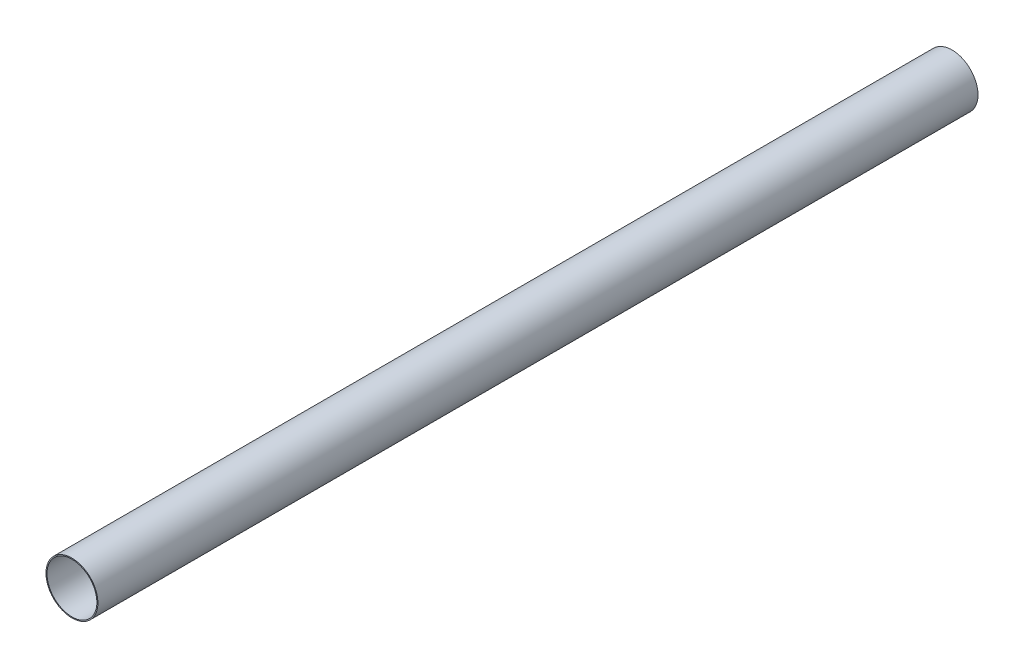
ISO-10303-21;
HEADER;
FILE_DESCRIPTION(('STEP AP214'),'2;1');
FILE_NAME('part.step','',(''),(''),'','','');
FILE_SCHEMA(('AUTOMOTIVE_DESIGN { 1 0 10303 214 1 1 1 1 }'));
ENDSEC;
DATA;
#1=APPLICATION_CONTEXT('core data for automotive mechanical design processes');
#2=APPLICATION_PROTOCOL_DEFINITION('international standard','automotive_design',2000,#1);
#3=PRODUCT_CONTEXT('',#1,'mechanical');
#4=PRODUCT('Part','Part','',(#3));
#5=PRODUCT_RELATED_PRODUCT_CATEGORY('part','',(#4));
#6=PRODUCT_DEFINITION_FORMATION('','',#4);
#7=PRODUCT_DEFINITION_CONTEXT('part definition',#1,'design');
#8=PRODUCT_DEFINITION('design','',#6,#7);
#9=PRODUCT_DEFINITION_SHAPE('','',#8);
#10=(LENGTH_UNIT() NAMED_UNIT(*) SI_UNIT(.MILLI.,.METRE.));
#11=(NAMED_UNIT(*) PLANE_ANGLE_UNIT() SI_UNIT($,.RADIAN.));
#12=(NAMED_UNIT(*) SI_UNIT($,.STERADIAN.) SOLID_ANGLE_UNIT());
#13=UNCERTAINTY_MEASURE_WITH_UNIT(LENGTH_MEASURE(1.E-05),#10,'distance_accuracy_value','');
#14=(GEOMETRIC_REPRESENTATION_CONTEXT(3) GLOBAL_UNCERTAINTY_ASSIGNED_CONTEXT((#13)) GLOBAL_UNIT_ASSIGNED_CONTEXT((#10,
#11,#12)) REPRESENTATION_CONTEXT('',''));
#15=CARTESIAN_POINT('',(0.,0.,0.));
#16=DIRECTION('',(0.,0.,1.));
#17=DIRECTION('',(1.,0.,0.));
#18=AXIS2_PLACEMENT_3D('',#15,#16,#17);
#19=CARTESIAN_POINT('',(0.,0.,5486.4));
#20=DIRECTION('',(0.,0.,1.));
#21=DIRECTION('',(1.,0.,0.));
#22=AXIS2_PLACEMENT_3D('',#19,#20,#21);
#23=PLANE('',#22);
#24=CARTESIAN_POINT('',(0.,0.,5486.4));
#25=DIRECTION('',(0.,0.,1.));
#26=DIRECTION('',(1.,0.,0.));
#27=AXIS2_PLACEMENT_3D('',#24,#25,#26);
#28=CIRCLE('',#27,161.925);
#29=CARTESIAN_POINT('',(161.925,0.,5486.4));
#30=VERTEX_POINT('',#29);
#31=EDGE_CURVE('E10',#30,#30,#28,.T.);
#32=ORIENTED_EDGE('',*,*,#31,.T.);
#33=EDGE_LOOP('',(#32));
#34=FACE_BOUND('',#33,.T.);
#35=CARTESIAN_POINT('',(0.,0.,5486.4));
#36=DIRECTION('',(0.,0.,1.));
#37=DIRECTION('',(1.,0.,0.));
#38=AXIS2_PLACEMENT_3D('',#35,#36,#37);
#39=CIRCLE('',#38,155.575);
#40=CARTESIAN_POINT('',(155.575,0.,5486.4));
#41=VERTEX_POINT('',#40);
#42=EDGE_CURVE('E39',#41,#41,#39,.T.);
#43=ORIENTED_EDGE('',*,*,#42,.F.);
#44=EDGE_LOOP('',(#43));
#45=FACE_BOUND('',#44,.T.);
#46=ADVANCED_FACE('F28',(#34,#45),#23,.T.);
#47=CARTESIAN_POINT('',(0.,0.,0.));
#48=DIRECTION('',(0.,0.,1.));
#49=DIRECTION('',(1.,0.,0.));
#50=AXIS2_PLACEMENT_3D('',#47,#48,#49);
#51=PLANE('',#50);
#52=CARTESIAN_POINT('',(0.,0.,0.));
#53=DIRECTION('',(0.,0.,1.));
#54=DIRECTION('',(1.,0.,0.));
#55=AXIS2_PLACEMENT_3D('',#52,#53,#54);
#56=CIRCLE('',#55,161.925);
#57=CARTESIAN_POINT('',(161.925,0.,0.));
#58=VERTEX_POINT('',#57);
#59=EDGE_CURVE('E32',#58,#58,#56,.T.);
#60=ORIENTED_EDGE('',*,*,#59,.F.);
#61=EDGE_LOOP('',(#60));
#62=FACE_BOUND('',#61,.T.);
#63=CARTESIAN_POINT('',(0.,0.,0.));
#64=DIRECTION('',(0.,0.,1.));
#65=DIRECTION('',(1.,0.,0.));
#66=AXIS2_PLACEMENT_3D('',#63,#64,#65);
#67=CIRCLE('',#66,155.575);
#68=CARTESIAN_POINT('',(155.575,0.,0.));
#69=VERTEX_POINT('',#68);
#70=EDGE_CURVE('E41',#69,#69,#67,.T.);
#71=ORIENTED_EDGE('',*,*,#70,.T.);
#72=EDGE_LOOP('',(#71));
#73=FACE_BOUND('',#72,.T.);
#74=ADVANCED_FACE('F51',(#62,#73),#51,.F.);
#75=CARTESIAN_POINT('',(0.,0.,5486.4));
#76=DIRECTION('',(0.,0.,-1.));
#77=DIRECTION('',(-1.,0.,0.));
#78=AXIS2_PLACEMENT_3D('',#75,#76,#77);
#79=CYLINDRICAL_SURFACE('',#78,161.925);
#80=ORIENTED_EDGE('',*,*,#31,.F.);
#81=EDGE_LOOP('',(#80));
#82=FACE_BOUND('',#81,.T.);
#83=ORIENTED_EDGE('',*,*,#59,.T.);
#84=EDGE_LOOP('',(#83));
#85=FACE_BOUND('',#84,.T.);
#86=ADVANCED_FACE('F30',(#82,#85),#79,.T.);
#87=CARTESIAN_POINT('',(0.,0.,5486.4));
#88=DIRECTION('',(0.,0.,-1.));
#89=DIRECTION('',(-1.,0.,0.));
#90=AXIS2_PLACEMENT_3D('',#87,#88,#89);
#91=CYLINDRICAL_SURFACE('',#90,155.575);
#92=ORIENTED_EDGE('',*,*,#42,.T.);
#93=EDGE_LOOP('',(#92));
#94=FACE_BOUND('',#93,.T.);
#95=ORIENTED_EDGE('',*,*,#70,.F.);
#96=EDGE_LOOP('',(#95));
#97=FACE_BOUND('',#96,.T.);
#98=ADVANCED_FACE('F47',(#94,#97),#91,.F.);
#99=CLOSED_SHELL('',(#46,#74,#86,#98));
#100=MANIFOLD_SOLID_BREP('B2',#99);
#101=ADVANCED_BREP_SHAPE_REPRESENTATION('',(#18,#100),#14);
#102=SHAPE_DEFINITION_REPRESENTATION(#9,#101);
ENDSEC;
END-ISO-10303-21;
